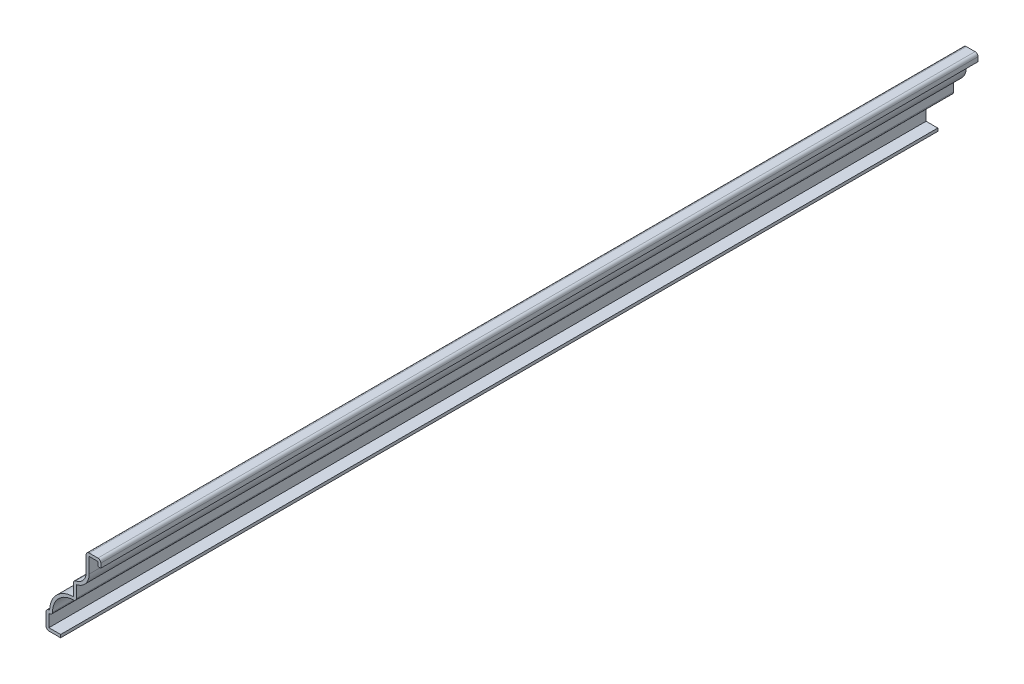
ISO-10303-21;
HEADER;
FILE_DESCRIPTION(('STEP AP214'),'2;1');
FILE_NAME('part.step','',(''),(''),'','','');
FILE_SCHEMA(('AUTOMOTIVE_DESIGN { 1 0 10303 214 1 1 1 1 }'));
ENDSEC;
DATA;
#1=APPLICATION_CONTEXT('core data for automotive mechanical design processes');
#2=APPLICATION_PROTOCOL_DEFINITION('international standard','automotive_design',2000,#1);
#3=PRODUCT_CONTEXT('',#1,'mechanical');
#4=PRODUCT('Part','Part','',(#3));
#5=PRODUCT_RELATED_PRODUCT_CATEGORY('part','',(#4));
#6=PRODUCT_DEFINITION_FORMATION('','',#4);
#7=PRODUCT_DEFINITION_CONTEXT('part definition',#1,'design');
#8=PRODUCT_DEFINITION('design','',#6,#7);
#9=PRODUCT_DEFINITION_SHAPE('','',#8);
#10=(LENGTH_UNIT() NAMED_UNIT(*) SI_UNIT(.MILLI.,.METRE.));
#11=(NAMED_UNIT(*) PLANE_ANGLE_UNIT() SI_UNIT($,.RADIAN.));
#12=(NAMED_UNIT(*) SI_UNIT($,.STERADIAN.) SOLID_ANGLE_UNIT());
#13=UNCERTAINTY_MEASURE_WITH_UNIT(LENGTH_MEASURE(1.E-05),#10,'distance_accuracy_value','');
#14=(GEOMETRIC_REPRESENTATION_CONTEXT(3) GLOBAL_UNCERTAINTY_ASSIGNED_CONTEXT((#13)) GLOBAL_UNIT_ASSIGNED_CONTEXT((#10,
#11,#12)) REPRESENTATION_CONTEXT('',''));
#15=CARTESIAN_POINT('',(0.,0.,0.));
#16=DIRECTION('',(0.,0.,1.));
#17=DIRECTION('',(1.,0.,0.));
#18=AXIS2_PLACEMENT_3D('',#15,#16,#17);
#19=CARTESIAN_POINT('',(-1.27,38.1,-381.));
#20=DIRECTION('',(-1.,0.,0.));
#21=DIRECTION('',(0.,-1.,0.));
#22=AXIS2_PLACEMENT_3D('',#19,#20,#21);
#23=PLANE('',#22);
#24=DIRECTION('',(0.,-1.,0.));
#25=VECTOR('',#24,1.);
#26=CARTESIAN_POINT('',(-1.27,38.1,0.));
#27=LINE('',#26,#25);
#28=CARTESIAN_POINT('',(-1.27,36.83,0.));
#29=VERTEX_POINT('',#28);
#30=CARTESIAN_POINT('',(-1.27,34.925,0.));
#31=VERTEX_POINT('',#30);
#32=EDGE_CURVE('E288',#29,#31,#27,.T.);
#33=ORIENTED_EDGE('',*,*,#32,.F.);
#34=DIRECTION('',(0.,0.,1.));
#35=VECTOR('',#34,1.);
#36=CARTESIAN_POINT('',(-1.27,36.83,-381.));
#37=LINE('',#36,#35);
#38=CARTESIAN_POINT('',(-1.27,36.83,-381.));
#39=VERTEX_POINT('',#38);
#40=EDGE_CURVE('E238',#39,#29,#37,.T.);
#41=ORIENTED_EDGE('',*,*,#40,.F.);
#42=DIRECTION('',(0.,-1.,0.));
#43=VECTOR('',#42,1.);
#44=CARTESIAN_POINT('',(-1.27,38.1,-381.));
#45=LINE('',#44,#43);
#46=CARTESIAN_POINT('',(-1.27,34.925,-381.));
#47=VERTEX_POINT('',#46);
#48=EDGE_CURVE('E220',#39,#47,#45,.T.);
#49=ORIENTED_EDGE('',*,*,#48,.T.);
#50=DIRECTION('',(0.,0.,1.));
#51=VECTOR('',#50,1.);
#52=CARTESIAN_POINT('',(-1.27,34.925,-381.));
#53=LINE('',#52,#51);
#54=EDGE_CURVE('E228',#47,#31,#53,.T.);
#55=ORIENTED_EDGE('',*,*,#54,.T.);
#56=EDGE_LOOP('',(#33,#41,#49,#55));
#57=FACE_BOUND('',#56,.T.);
#58=ADVANCED_FACE('F34',(#57),#23,.T.);
#59=CARTESIAN_POINT('',(-6.35,36.83,-381.));
#60=DIRECTION('',(0.,-1.,0.));
#61=DIRECTION('',(0.,0.,-1.));
#62=AXIS2_PLACEMENT_3D('',#59,#60,#61);
#63=PLANE('',#62);
#64=DIRECTION('',(1.,0.,0.));
#65=VECTOR('',#64,1.);
#66=CARTESIAN_POINT('',(-6.35,36.83,0.));
#67=LINE('',#66,#65);
#68=CARTESIAN_POINT('',(-5.08,36.83,0.));
#69=VERTEX_POINT('',#68);
#70=EDGE_CURVE('E239',#69,#29,#67,.T.);
#71=ORIENTED_EDGE('',*,*,#70,.F.);
#72=DIRECTION('',(0.,0.,1.));
#73=VECTOR('',#72,1.);
#74=CARTESIAN_POINT('',(-5.08,36.83,-381.));
#75=LINE('',#74,#73);
#76=CARTESIAN_POINT('',(-5.08,36.83,-381.));
#77=VERTEX_POINT('',#76);
#78=EDGE_CURVE('E336',#77,#69,#75,.T.);
#79=ORIENTED_EDGE('',*,*,#78,.F.);
#80=DIRECTION('',(1.,0.,0.));
#81=VECTOR('',#80,1.);
#82=CARTESIAN_POINT('',(-6.35,36.83,-381.));
#83=LINE('',#82,#81);
#84=EDGE_CURVE('E236',#77,#39,#83,.T.);
#85=ORIENTED_EDGE('',*,*,#84,.T.);
#86=ORIENTED_EDGE('',*,*,#40,.T.);
#87=EDGE_LOOP('',(#71,#79,#85,#86));
#88=FACE_BOUND('',#87,.T.);
#89=ADVANCED_FACE('F454',(#88),#63,.T.);
#90=CARTESIAN_POINT('',(-5.08,30.1625,-381.));
#91=DIRECTION('',(1.,0.,0.));
#92=DIRECTION('',(0.,1.,0.));
#93=AXIS2_PLACEMENT_3D('',#90,#91,#92);
#94=PLANE('',#93);
#95=DIRECTION('',(0.,1.,0.));
#96=VECTOR('',#95,1.);
#97=CARTESIAN_POINT('',(-5.08,30.1625,0.));
#98=LINE('',#97,#96);
#99=CARTESIAN_POINT('',(-5.08,30.1625,0.));
#100=VERTEX_POINT('',#99);
#101=EDGE_CURVE('E242',#100,#69,#98,.T.);
#102=ORIENTED_EDGE('',*,*,#101,.F.);
#103=DIRECTION('',(0.,0.,1.));
#104=VECTOR('',#103,1.);
#105=CARTESIAN_POINT('',(-5.08,30.1625,-381.));
#106=LINE('',#105,#104);
#107=CARTESIAN_POINT('',(-5.08,30.1625,-381.));
#108=VERTEX_POINT('',#107);
#109=EDGE_CURVE('E338',#108,#100,#106,.T.);
#110=ORIENTED_EDGE('',*,*,#109,.F.);
#111=DIRECTION('',(0.,1.,0.));
#112=VECTOR('',#111,1.);
#113=CARTESIAN_POINT('',(-5.08,30.1625,-381.));
#114=LINE('',#113,#112);
#115=EDGE_CURVE('E284',#108,#77,#114,.T.);
#116=ORIENTED_EDGE('',*,*,#115,.T.);
#117=ORIENTED_EDGE('',*,*,#78,.T.);
#118=EDGE_LOOP('',(#102,#110,#116,#117));
#119=FACE_BOUND('',#118,.T.);
#120=ADVANCED_FACE('F535',(#119),#94,.T.);
#121=CARTESIAN_POINT('',(-11.90625,30.1625,-381.));
#122=DIRECTION('',(0.,0.,1.));
#123=DIRECTION('',(1.,0.,0.));
#124=AXIS2_PLACEMENT_3D('',#121,#122,#123);
#125=CYLINDRICAL_SURFACE('',#124,6.82625);
#126=CARTESIAN_POINT('',(-11.90625,30.1625,0.));
#127=DIRECTION('',(0.,0.,1.));
#128=DIRECTION('',(1.,0.,0.));
#129=AXIS2_PLACEMENT_3D('',#126,#127,#128);
#130=CIRCLE('',#129,6.82625);
#131=CARTESIAN_POINT('',(-10.63625,23.4554299196669,0.));
#132=VERTEX_POINT('',#131);
#133=EDGE_CURVE('E329',#132,#100,#130,.T.);
#134=ORIENTED_EDGE('',*,*,#133,.F.);
#135=DIRECTION('',(0.,0.,1.));
#136=VECTOR('',#135,1.);
#137=CARTESIAN_POINT('',(-10.63625,23.4554299196669,-381.));
#138=LINE('',#137,#136);
#139=CARTESIAN_POINT('',(-10.63625,23.4554299196669,-381.));
#140=VERTEX_POINT('',#139);
#141=EDGE_CURVE('E340',#140,#132,#138,.T.);
#142=ORIENTED_EDGE('',*,*,#141,.F.);
#143=CARTESIAN_POINT('',(-11.90625,30.1625,-381.));
#144=DIRECTION('',(0.,0.,1.));
#145=DIRECTION('',(1.,0.,0.));
#146=AXIS2_PLACEMENT_3D('',#143,#144,#145);
#147=CIRCLE('',#146,6.82625);
#148=EDGE_CURVE('E281',#140,#108,#147,.T.);
#149=ORIENTED_EDGE('',*,*,#148,.T.);
#150=ORIENTED_EDGE('',*,*,#109,.T.);
#151=EDGE_LOOP('',(#134,#142,#149,#150));
#152=FACE_BOUND('',#151,.T.);
#153=ADVANCED_FACE('F462',(#152),#125,.T.);
#154=CARTESIAN_POINT('',(-10.63625,18.25625,-381.));
#155=DIRECTION('',(1.,0.,0.));
#156=DIRECTION('',(0.,1.,0.));
#157=AXIS2_PLACEMENT_3D('',#154,#155,#156);
#158=PLANE('',#157);
#159=DIRECTION('',(0.,1.,0.));
#160=VECTOR('',#159,1.);
#161=CARTESIAN_POINT('',(-10.63625,18.25625,0.));
#162=LINE('',#161,#160);
#163=CARTESIAN_POINT('',(-10.63625,18.25625,0.));
#164=VERTEX_POINT('',#163);
#165=EDGE_CURVE('E327',#164,#132,#162,.T.);
#166=ORIENTED_EDGE('',*,*,#165,.F.);
#167=DIRECTION('',(0.,0.,1.));
#168=VECTOR('',#167,1.);
#169=CARTESIAN_POINT('',(-10.63625,18.25625,-381.));
#170=LINE('',#169,#168);
#171=CARTESIAN_POINT('',(-10.63625,18.25625,-381.));
#172=VERTEX_POINT('',#171);
#173=EDGE_CURVE('E406',#164,#172,#170,.F.);
#174=ORIENTED_EDGE('',*,*,#173,.T.);
#175=DIRECTION('',(0.,1.,0.));
#176=VECTOR('',#175,1.);
#177=CARTESIAN_POINT('',(-10.63625,18.25625,-381.));
#178=LINE('',#177,#176);
#179=EDGE_CURVE('E279',#172,#140,#178,.T.);
#180=ORIENTED_EDGE('',*,*,#179,.T.);
#181=ORIENTED_EDGE('',*,*,#141,.T.);
#182=EDGE_LOOP('',(#166,#174,#180,#181));
#183=FACE_BOUND('',#182,.T.);
#184=ADVANCED_FACE('F465',(#183),#158,.T.);
#185=CARTESIAN_POINT('',(-11.90625,7.9375,-381.));
#186=DIRECTION('',(0.,0.,1.));
#187=DIRECTION('',(1.,0.,0.));
#188=AXIS2_PLACEMENT_3D('',#185,#186,#187);
#189=CYLINDRICAL_SURFACE('',#188,9.04875);
#190=CARTESIAN_POINT('',(-11.90625,7.9375,0.));
#191=DIRECTION('',(0.,0.,1.));
#192=DIRECTION('',(1.,0.,0.));
#193=AXIS2_PLACEMENT_3D('',#190,#191,#192);
#194=CIRCLE('',#193,9.04875);
#195=CARTESIAN_POINT('',(-20.955,7.9375,0.));
#196=VERTEX_POINT('',#195);
#197=CARTESIAN_POINT('',(-11.90625,16.98625,0.));
#198=VERTEX_POINT('',#197);
#199=EDGE_CURVE('E324',#196,#198,#194,.F.);
#200=ORIENTED_EDGE('',*,*,#199,.F.);
#201=DIRECTION('',(0.,0.,1.));
#202=VECTOR('',#201,1.);
#203=CARTESIAN_POINT('',(-20.955,7.9375,-381.));
#204=LINE('',#203,#202);
#205=CARTESIAN_POINT('',(-20.955,7.9375,-381.));
#206=VERTEX_POINT('',#205);
#207=EDGE_CURVE('E404',#196,#206,#204,.F.);
#208=ORIENTED_EDGE('',*,*,#207,.T.);
#209=CARTESIAN_POINT('',(-11.90625,7.9375,-381.));
#210=DIRECTION('',(0.,0.,1.));
#211=DIRECTION('',(1.,0.,0.));
#212=AXIS2_PLACEMENT_3D('',#209,#210,#211);
#213=CIRCLE('',#212,9.04875);
#214=CARTESIAN_POINT('',(-11.90625,16.98625,-381.));
#215=VERTEX_POINT('',#214);
#216=EDGE_CURVE('E276',#206,#215,#213,.F.);
#217=ORIENTED_EDGE('',*,*,#216,.T.);
#218=DIRECTION('',(0.,0.,1.));
#219=VECTOR('',#218,1.);
#220=CARTESIAN_POINT('',(-11.90625,16.98625,-381.));
#221=LINE('',#220,#219);
#222=EDGE_CURVE('E401',#215,#198,#221,.T.);
#223=ORIENTED_EDGE('',*,*,#222,.T.);
#224=EDGE_LOOP('',(#200,#208,#217,#223));
#225=FACE_BOUND('',#224,.T.);
#226=ADVANCED_FACE('F474',(#225),#189,.F.);
#227=CARTESIAN_POINT('',(-23.8125,6.6675,-381.));
#228=DIRECTION('',(0.,-1.,0.));
#229=DIRECTION('',(1.,0.,0.));
#230=AXIS2_PLACEMENT_3D('',#227,#228,#229);
#231=PLANE('',#230);
#232=DIRECTION('',(1.,0.,0.));
#233=VECTOR('',#232,1.);
#234=CARTESIAN_POINT('',(-23.8125,6.6675,-381.));
#235=LINE('',#234,#233);
#236=CARTESIAN_POINT('',(-22.5425,6.6675,-381.));
#237=VERTEX_POINT('',#236);
#238=CARTESIAN_POINT('',(-22.225,6.6675,-381.));
#239=VERTEX_POINT('',#238);
#240=EDGE_CURVE('E273',#237,#239,#235,.T.);
#241=ORIENTED_EDGE('',*,*,#240,.T.);
#242=DIRECTION('',(0.,0.,1.));
#243=VECTOR('',#242,1.);
#244=CARTESIAN_POINT('',(-22.225,6.6675,-381.));
#245=LINE('',#244,#243);
#246=CARTESIAN_POINT('',(-22.225,6.6675,0.));
#247=VERTEX_POINT('',#246);
#248=EDGE_CURVE('E398',#239,#247,#245,.T.);
#249=ORIENTED_EDGE('',*,*,#248,.T.);
#250=DIRECTION('',(1.,0.,0.));
#251=VECTOR('',#250,1.);
#252=CARTESIAN_POINT('',(-23.8125,6.6675,0.));
#253=LINE('',#252,#251);
#254=CARTESIAN_POINT('',(-22.5425,6.6675,0.));
#255=VERTEX_POINT('',#254);
#256=EDGE_CURVE('E321',#255,#247,#253,.T.);
#257=ORIENTED_EDGE('',*,*,#256,.F.);
#258=DIRECTION('',(0.,0.,1.));
#259=VECTOR('',#258,1.);
#260=CARTESIAN_POINT('',(-22.5425,6.6675,-381.));
#261=LINE('',#260,#259);
#262=EDGE_CURVE('E343',#237,#255,#261,.T.);
#263=ORIENTED_EDGE('',*,*,#262,.F.);
#264=EDGE_LOOP('',(#241,#249,#257,#263));
#265=FACE_BOUND('',#264,.T.);
#266=ADVANCED_FACE('F482',(#265),#231,.T.);
#267=CARTESIAN_POINT('',(-22.5425,0.,-381.));
#268=DIRECTION('',(1.,0.,0.));
#269=DIRECTION('',(0.,0.,-1.));
#270=AXIS2_PLACEMENT_3D('',#267,#268,#269);
#271=PLANE('',#270);
#272=DIRECTION('',(0.,1.,0.));
#273=VECTOR('',#272,1.);
#274=CARTESIAN_POINT('',(-22.5425,0.,0.));
#275=LINE('',#274,#273);
#276=CARTESIAN_POINT('',(-22.5425,1.27,0.));
#277=VERTEX_POINT('',#276);
#278=EDGE_CURVE('E318',#277,#255,#275,.T.);
#279=ORIENTED_EDGE('',*,*,#278,.F.);
#280=DIRECTION('',(0.,0.,1.));
#281=VECTOR('',#280,1.);
#282=CARTESIAN_POINT('',(-22.5425,1.27,-381.));
#283=LINE('',#282,#281);
#284=CARTESIAN_POINT('',(-22.5425,1.27,-381.));
#285=VERTEX_POINT('',#284);
#286=EDGE_CURVE('E345',#285,#277,#283,.T.);
#287=ORIENTED_EDGE('',*,*,#286,.F.);
#288=DIRECTION('',(0.,1.,0.));
#289=VECTOR('',#288,1.);
#290=CARTESIAN_POINT('',(-22.5425,0.,-381.));
#291=LINE('',#290,#289);
#292=EDGE_CURVE('E270',#285,#237,#291,.T.);
#293=ORIENTED_EDGE('',*,*,#292,.T.);
#294=ORIENTED_EDGE('',*,*,#262,.T.);
#295=EDGE_LOOP('',(#279,#287,#293,#294));
#296=FACE_BOUND('',#295,.T.);
#297=ADVANCED_FACE('F488',(#296),#271,.T.);
#298=CARTESIAN_POINT('',(-17.4625,1.27,-381.));
#299=DIRECTION('',(0.,1.,0.));
#300=DIRECTION('',(-1.,0.,0.));
#301=AXIS2_PLACEMENT_3D('',#298,#299,#300);
#302=PLANE('',#301);
#303=DIRECTION('',(-1.,0.,0.));
#304=VECTOR('',#303,1.);
#305=CARTESIAN_POINT('',(-17.4625,1.27,0.));
#306=LINE('',#305,#304);
#307=CARTESIAN_POINT('',(-17.4625,1.27,0.));
#308=VERTEX_POINT('',#307);
#309=EDGE_CURVE('E315',#308,#277,#306,.T.);
#310=ORIENTED_EDGE('',*,*,#309,.F.);
#311=DIRECTION('',(0.,0.,1.));
#312=VECTOR('',#311,1.);
#313=CARTESIAN_POINT('',(-17.4625,1.27,-381.));
#314=LINE('',#313,#312);
#315=CARTESIAN_POINT('',(-17.4625,1.27,-381.));
#316=VERTEX_POINT('',#315);
#317=EDGE_CURVE('E347',#316,#308,#314,.T.);
#318=ORIENTED_EDGE('',*,*,#317,.F.);
#319=DIRECTION('',(-1.,0.,0.));
#320=VECTOR('',#319,1.);
#321=CARTESIAN_POINT('',(-17.4625,1.27,-381.));
#322=LINE('',#321,#320);
#323=EDGE_CURVE('E267',#316,#285,#322,.T.);
#324=ORIENTED_EDGE('',*,*,#323,.T.);
#325=ORIENTED_EDGE('',*,*,#286,.T.);
#326=EDGE_LOOP('',(#310,#318,#324,#325));
#327=FACE_BOUND('',#326,.T.);
#328=ADVANCED_FACE('F491',(#327),#302,.T.);
#329=CARTESIAN_POINT('',(-17.4625,1.27,-381.));
#330=DIRECTION('',(-1.,0.,0.));
#331=DIRECTION('',(0.,0.,1.));
#332=AXIS2_PLACEMENT_3D('',#329,#330,#331);
#333=PLANE('',#332);
#334=DIRECTION('',(0.,-1.,0.));
#335=VECTOR('',#334,1.);
#336=CARTESIAN_POINT('',(-17.4625,1.27,0.));
#337=LINE('',#336,#335);
#338=CARTESIAN_POINT('',(-17.4625,0.,0.));
#339=VERTEX_POINT('',#338);
#340=EDGE_CURVE('E313',#308,#339,#337,.T.);
#341=ORIENTED_EDGE('',*,*,#340,.T.);
#342=DIRECTION('',(0.,0.,1.));
#343=VECTOR('',#342,1.);
#344=CARTESIAN_POINT('',(-17.4625,0.,-381.));
#345=LINE('',#344,#343);
#346=CARTESIAN_POINT('',(-17.4625,0.,-381.));
#347=VERTEX_POINT('',#346);
#348=EDGE_CURVE('E349',#347,#339,#345,.T.);
#349=ORIENTED_EDGE('',*,*,#348,.F.);
#350=DIRECTION('',(0.,-1.,0.));
#351=VECTOR('',#350,1.);
#352=CARTESIAN_POINT('',(-17.4625,1.27,-381.));
#353=LINE('',#352,#351);
#354=EDGE_CURVE('E265',#316,#347,#353,.T.);
#355=ORIENTED_EDGE('',*,*,#354,.F.);
#356=ORIENTED_EDGE('',*,*,#317,.T.);
#357=EDGE_LOOP('',(#341,#349,#355,#356));
#358=FACE_BOUND('',#357,.T.);
#359=ADVANCED_FACE('F497',(#358),#333,.F.);
#360=CARTESIAN_POINT('',(-17.4625,0.,-381.));
#361=DIRECTION('',(0.,1.,0.));
#362=DIRECTION('',(-1.,0.,0.));
#363=AXIS2_PLACEMENT_3D('',#360,#361,#362);
#364=PLANE('',#363);
#365=DIRECTION('',(-1.,0.,0.));
#366=VECTOR('',#365,1.);
#367=CARTESIAN_POINT('',(-17.4625,0.,0.));
#368=LINE('',#367,#366);
#369=CARTESIAN_POINT('',(-22.5425,0.,0.));
#370=VERTEX_POINT('',#369);
#371=EDGE_CURVE('E310',#339,#370,#368,.T.);
#372=ORIENTED_EDGE('',*,*,#371,.T.);
#373=DIRECTION('',(0.,0.,1.));
#374=VECTOR('',#373,1.);
#375=CARTESIAN_POINT('',(-22.5425,0.,-381.));
#376=LINE('',#375,#374);
#377=CARTESIAN_POINT('',(-22.5425,0.,-381.));
#378=VERTEX_POINT('',#377);
#379=EDGE_CURVE('E380',#370,#378,#376,.F.);
#380=ORIENTED_EDGE('',*,*,#379,.T.);
#381=DIRECTION('',(-1.,0.,0.));
#382=VECTOR('',#381,1.);
#383=CARTESIAN_POINT('',(-17.4625,0.,-381.));
#384=LINE('',#383,#382);
#385=EDGE_CURVE('E263',#347,#378,#384,.T.);
#386=ORIENTED_EDGE('',*,*,#385,.F.);
#387=ORIENTED_EDGE('',*,*,#348,.T.);
#388=EDGE_LOOP('',(#372,#380,#386,#387));
#389=FACE_BOUND('',#388,.T.);
#390=ADVANCED_FACE('F501',(#389),#364,.F.);
#391=CARTESIAN_POINT('',(-23.8125,0.,-381.));
#392=DIRECTION('',(1.,0.,0.));
#393=DIRECTION('',(0.,0.,-1.));
#394=AXIS2_PLACEMENT_3D('',#391,#392,#393);
#395=PLANE('',#394);
#396=DIRECTION('',(0.,1.,0.));
#397=VECTOR('',#396,1.);
#398=CARTESIAN_POINT('',(-23.8125,0.,-381.));
#399=LINE('',#398,#397);
#400=CARTESIAN_POINT('',(-23.8125,1.27,-381.));
#401=VERTEX_POINT('',#400);
#402=CARTESIAN_POINT('',(-23.8125,6.6675,-381.));
#403=VERTEX_POINT('',#402);
#404=EDGE_CURVE('E260',#401,#403,#399,.T.);
#405=ORIENTED_EDGE('',*,*,#404,.F.);
#406=DIRECTION('',(0.,0.,1.));
#407=VECTOR('',#406,1.);
#408=CARTESIAN_POINT('',(-23.8125,1.27,-381.));
#409=LINE('',#408,#407);
#410=CARTESIAN_POINT('',(-23.8125,1.27,0.));
#411=VERTEX_POINT('',#410);
#412=EDGE_CURVE('E363',#401,#411,#409,.T.);
#413=ORIENTED_EDGE('',*,*,#412,.T.);
#414=DIRECTION('',(0.,1.,0.));
#415=VECTOR('',#414,1.);
#416=CARTESIAN_POINT('',(-23.8125,0.,0.));
#417=LINE('',#416,#415);
#418=CARTESIAN_POINT('',(-23.8125,6.6675,0.));
#419=VERTEX_POINT('',#418);
#420=EDGE_CURVE('E307',#411,#419,#417,.T.);
#421=ORIENTED_EDGE('',*,*,#420,.T.);
#422=DIRECTION('',(0.,0.,1.));
#423=VECTOR('',#422,1.);
#424=CARTESIAN_POINT('',(-23.8125,6.6675,-381.));
#425=LINE('',#424,#423);
#426=EDGE_CURVE('E335',#419,#403,#425,.F.);
#427=ORIENTED_EDGE('',*,*,#426,.T.);
#428=EDGE_LOOP('',(#405,#413,#421,#427));
#429=FACE_BOUND('',#428,.T.);
#430=ADVANCED_FACE('F509',(#429),#395,.F.);
#431=CARTESIAN_POINT('',(-23.8125,7.9375,-381.));
#432=DIRECTION('',(0.,-1.,0.));
#433=DIRECTION('',(1.,0.,0.));
#434=AXIS2_PLACEMENT_3D('',#431,#432,#433);
#435=PLANE('',#434);
#436=DIRECTION('',(1.,0.,0.));
#437=VECTOR('',#436,1.);
#438=CARTESIAN_POINT('',(-23.8125,7.9375,-381.));
#439=LINE('',#438,#437);
#440=CARTESIAN_POINT('',(-22.5425,7.9375,-381.));
#441=VERTEX_POINT('',#440);
#442=CARTESIAN_POINT('',(-22.225,7.9375,-381.));
#443=VERTEX_POINT('',#442);
#444=EDGE_CURVE('E258',#441,#443,#439,.T.);
#445=ORIENTED_EDGE('',*,*,#444,.F.);
#446=DIRECTION('',(0.,0.,1.));
#447=VECTOR('',#446,1.);
#448=CARTESIAN_POINT('',(-22.5425,7.9375,-381.));
#449=LINE('',#448,#447);
#450=CARTESIAN_POINT('',(-22.5425,7.9375,0.));
#451=VERTEX_POINT('',#450);
#452=EDGE_CURVE('E395',#441,#451,#449,.T.);
#453=ORIENTED_EDGE('',*,*,#452,.T.);
#454=DIRECTION('',(1.,0.,0.));
#455=VECTOR('',#454,1.);
#456=CARTESIAN_POINT('',(-23.8125,7.9375,0.));
#457=LINE('',#456,#455);
#458=CARTESIAN_POINT('',(-22.225,7.9375,0.));
#459=VERTEX_POINT('',#458);
#460=EDGE_CURVE('E305',#451,#459,#457,.T.);
#461=ORIENTED_EDGE('',*,*,#460,.T.);
#462=DIRECTION('',(0.,0.,1.));
#463=VECTOR('',#462,1.);
#464=CARTESIAN_POINT('',(-22.225,7.9375,-381.));
#465=LINE('',#464,#463);
#466=EDGE_CURVE('E352',#443,#459,#465,.T.);
#467=ORIENTED_EDGE('',*,*,#466,.F.);
#468=EDGE_LOOP('',(#445,#453,#461,#467));
#469=FACE_BOUND('',#468,.T.);
#470=ADVANCED_FACE('F517',(#469),#435,.F.);
#471=CARTESIAN_POINT('',(-11.90625,7.9375,-381.));
#472=DIRECTION('',(0.,0.,1.));
#473=DIRECTION('',(1.,0.,0.));
#474=AXIS2_PLACEMENT_3D('',#471,#472,#473);
#475=CYLINDRICAL_SURFACE('',#474,10.31875);
#476=CARTESIAN_POINT('',(-11.90625,7.9375,0.));
#477=DIRECTION('',(0.,0.,-1.));
#478=DIRECTION('',(-1.,0.,0.));
#479=AXIS2_PLACEMENT_3D('',#476,#477,#478);
#480=CIRCLE('',#479,10.31875);
#481=CARTESIAN_POINT('',(-11.90625,18.25625,0.));
#482=VERTEX_POINT('',#481);
#483=EDGE_CURVE('E303',#459,#482,#480,.T.);
#484=ORIENTED_EDGE('',*,*,#483,.T.);
#485=DIRECTION('',(0.,0.,1.));
#486=VECTOR('',#485,1.);
#487=CARTESIAN_POINT('',(-11.90625,18.25625,-381.));
#488=LINE('',#487,#486);
#489=CARTESIAN_POINT('',(-11.90625,18.25625,-381.));
#490=VERTEX_POINT('',#489);
#491=EDGE_CURVE('E355',#490,#482,#488,.T.);
#492=ORIENTED_EDGE('',*,*,#491,.F.);
#493=CARTESIAN_POINT('',(-11.90625,7.9375,-381.));
#494=DIRECTION('',(0.,0.,-1.));
#495=DIRECTION('',(-1.,0.,0.));
#496=AXIS2_PLACEMENT_3D('',#493,#494,#495);
#497=CIRCLE('',#496,10.31875);
#498=EDGE_CURVE('E256',#443,#490,#497,.T.);
#499=ORIENTED_EDGE('',*,*,#498,.F.);
#500=ORIENTED_EDGE('',*,*,#466,.T.);
#501=EDGE_LOOP('',(#484,#492,#499,#500));
#502=FACE_BOUND('',#501,.T.);
#503=ADVANCED_FACE('F521',(#502),#475,.T.);
#504=CARTESIAN_POINT('',(-11.90625,18.25625,-381.));
#505=DIRECTION('',(1.,0.,0.));
#506=DIRECTION('',(0.,1.,0.));
#507=AXIS2_PLACEMENT_3D('',#504,#505,#506);
#508=PLANE('',#507);
#509=DIRECTION('',(0.,1.,0.));
#510=VECTOR('',#509,1.);
#511=CARTESIAN_POINT('',(-11.90625,18.25625,0.));
#512=LINE('',#511,#510);
#513=CARTESIAN_POINT('',(-11.90625,23.4554299196669,0.));
#514=VERTEX_POINT('',#513);
#515=EDGE_CURVE('E300',#482,#514,#512,.T.);
#516=ORIENTED_EDGE('',*,*,#515,.T.);
#517=DIRECTION('',(0.,0.,1.));
#518=VECTOR('',#517,1.);
#519=CARTESIAN_POINT('',(-11.90625,23.4554299196669,-381.));
#520=LINE('',#519,#518);
#521=CARTESIAN_POINT('',(-11.90625,23.4554299196669,-381.));
#522=VERTEX_POINT('',#521);
#523=EDGE_CURVE('E42',#514,#522,#520,.F.);
#524=ORIENTED_EDGE('',*,*,#523,.T.);
#525=DIRECTION('',(0.,1.,0.));
#526=VECTOR('',#525,1.);
#527=CARTESIAN_POINT('',(-11.90625,18.25625,-381.));
#528=LINE('',#527,#526);
#529=EDGE_CURVE('E253',#490,#522,#528,.T.);
#530=ORIENTED_EDGE('',*,*,#529,.F.);
#531=ORIENTED_EDGE('',*,*,#491,.T.);
#532=EDGE_LOOP('',(#516,#524,#530,#531));
#533=FACE_BOUND('',#532,.T.);
#534=ADVANCED_FACE('F419',(#533),#508,.F.);
#535=CARTESIAN_POINT('',(-11.90625,30.1625,-381.));
#536=DIRECTION('',(0.,0.,1.));
#537=DIRECTION('',(1.,0.,0.));
#538=AXIS2_PLACEMENT_3D('',#535,#536,#537);
#539=CYLINDRICAL_SURFACE('',#538,5.55625);
#540=CARTESIAN_POINT('',(-11.90625,30.1625,-381.));
#541=DIRECTION('',(0.,0.,1.));
#542=DIRECTION('',(1.,0.,0.));
#543=AXIS2_PLACEMENT_3D('',#540,#541,#542);
#544=CIRCLE('',#543,5.55625);
#545=CARTESIAN_POINT('',(-10.8725290697674,24.7032569113567,-381.));
#546=VERTEX_POINT('',#545);
#547=CARTESIAN_POINT('',(-6.35,30.1625,-381.));
#548=VERTEX_POINT('',#547);
#549=EDGE_CURVE('E251',#546,#548,#544,.T.);
#550=ORIENTED_EDGE('',*,*,#549,.F.);
#551=DIRECTION('',(0.,0.,1.));
#552=VECTOR('',#551,1.);
#553=CARTESIAN_POINT('',(-10.8725290697674,24.7032569113567,-381.));
#554=LINE('',#553,#552);
#555=CARTESIAN_POINT('',(-10.8725290697674,24.7032569113567,0.));
#556=VERTEX_POINT('',#555);
#557=EDGE_CURVE('E414',#546,#556,#554,.T.);
#558=ORIENTED_EDGE('',*,*,#557,.T.);
#559=CARTESIAN_POINT('',(-11.90625,30.1625,0.));
#560=DIRECTION('',(0.,0.,1.));
#561=DIRECTION('',(1.,0.,0.));
#562=AXIS2_PLACEMENT_3D('',#559,#560,#561);
#563=CIRCLE('',#562,5.55625);
#564=CARTESIAN_POINT('',(-6.35,30.1625,0.));
#565=VERTEX_POINT('',#564);
#566=EDGE_CURVE('E298',#556,#565,#563,.T.);
#567=ORIENTED_EDGE('',*,*,#566,.T.);
#568=DIRECTION('',(0.,0.,1.));
#569=VECTOR('',#568,1.);
#570=CARTESIAN_POINT('',(-6.35,30.1625,-381.));
#571=LINE('',#570,#569);
#572=EDGE_CURVE('E358',#548,#565,#571,.T.);
#573=ORIENTED_EDGE('',*,*,#572,.F.);
#574=EDGE_LOOP('',(#550,#558,#567,#573));
#575=FACE_BOUND('',#574,.T.);
#576=ADVANCED_FACE('F430',(#575),#539,.F.);
#577=CARTESIAN_POINT('',(-6.35,30.1625,-381.));
#578=DIRECTION('',(1.,0.,0.));
#579=DIRECTION('',(0.,1.,0.));
#580=AXIS2_PLACEMENT_3D('',#577,#578,#579);
#581=PLANE('',#580);
#582=DIRECTION('',(0.,1.,0.));
#583=VECTOR('',#582,1.);
#584=CARTESIAN_POINT('',(-6.35,30.1625,0.));
#585=LINE('',#584,#583);
#586=CARTESIAN_POINT('',(-6.35,36.83,0.));
#587=VERTEX_POINT('',#586);
#588=EDGE_CURVE('E295',#565,#587,#585,.T.);
#589=ORIENTED_EDGE('',*,*,#588,.T.);
#590=DIRECTION('',(0.,0.,1.));
#591=VECTOR('',#590,1.);
#592=CARTESIAN_POINT('',(-6.35,36.83,-381.));
#593=LINE('',#592,#591);
#594=CARTESIAN_POINT('',(-6.35,36.83,-381.));
#595=VERTEX_POINT('',#594);
#596=EDGE_CURVE('E412',#587,#595,#593,.F.);
#597=ORIENTED_EDGE('',*,*,#596,.T.);
#598=DIRECTION('',(0.,1.,0.));
#599=VECTOR('',#598,1.);
#600=CARTESIAN_POINT('',(-6.35,30.1625,-381.));
#601=LINE('',#600,#599);
#602=EDGE_CURVE('E248',#548,#595,#601,.T.);
#603=ORIENTED_EDGE('',*,*,#602,.F.);
#604=ORIENTED_EDGE('',*,*,#572,.T.);
#605=EDGE_LOOP('',(#589,#597,#603,#604));
#606=FACE_BOUND('',#605,.T.);
#607=ADVANCED_FACE('F439',(#606),#581,.F.);
#608=CARTESIAN_POINT('',(-6.35,38.1,-381.));
#609=DIRECTION('',(0.,-1.,0.));
#610=DIRECTION('',(0.,0.,-1.));
#611=AXIS2_PLACEMENT_3D('',#608,#609,#610);
#612=PLANE('',#611);
#613=DIRECTION('',(1.,0.,0.));
#614=VECTOR('',#613,1.);
#615=CARTESIAN_POINT('',(-6.35,38.1,-381.));
#616=LINE('',#615,#614);
#617=CARTESIAN_POINT('',(-5.08,38.1,-381.));
#618=VERTEX_POINT('',#617);
#619=CARTESIAN_POINT('',(-1.27,38.1,-381.));
#620=VERTEX_POINT('',#619);
#621=EDGE_CURVE('E246',#618,#620,#616,.T.);
#622=ORIENTED_EDGE('',*,*,#621,.F.);
#623=DIRECTION('',(0.,0.,1.));
#624=VECTOR('',#623,1.);
#625=CARTESIAN_POINT('',(-5.08,38.1,-381.));
#626=LINE('',#625,#624);
#627=CARTESIAN_POINT('',(-5.08,38.1,0.));
#628=VERTEX_POINT('',#627);
#629=EDGE_CURVE('E409',#618,#628,#626,.T.);
#630=ORIENTED_EDGE('',*,*,#629,.T.);
#631=DIRECTION('',(1.,0.,0.));
#632=VECTOR('',#631,1.);
#633=CARTESIAN_POINT('',(-6.35,38.1,0.));
#634=LINE('',#633,#632);
#635=CARTESIAN_POINT('',(-1.27,38.1,0.));
#636=VERTEX_POINT('',#635);
#637=EDGE_CURVE('E293',#628,#636,#634,.T.);
#638=ORIENTED_EDGE('',*,*,#637,.T.);
#639=DIRECTION('',(0.,0.,1.));
#640=VECTOR('',#639,1.);
#641=CARTESIAN_POINT('',(-1.27,38.1,-381.));
#642=LINE('',#641,#640);
#643=EDGE_CURVE('E57',#636,#620,#642,.F.);
#644=ORIENTED_EDGE('',*,*,#643,.T.);
#645=EDGE_LOOP('',(#622,#630,#638,#644));
#646=FACE_BOUND('',#645,.T.);
#647=ADVANCED_FACE('F445',(#646),#612,.F.);
#648=CARTESIAN_POINT('',(0.,38.1,-381.));
#649=DIRECTION('',(-1.,0.,0.));
#650=DIRECTION('',(0.,-1.,0.));
#651=AXIS2_PLACEMENT_3D('',#648,#649,#650);
#652=PLANE('',#651);
#653=DIRECTION('',(0.,-1.,0.));
#654=VECTOR('',#653,1.);
#655=CARTESIAN_POINT('',(0.,38.1,-381.));
#656=LINE('',#655,#654);
#657=CARTESIAN_POINT('',(0.,36.83,-381.));
#658=VERTEX_POINT('',#657);
#659=CARTESIAN_POINT('',(0.,34.925,-381.));
#660=VERTEX_POINT('',#659);
#661=EDGE_CURVE('E222',#658,#660,#656,.T.);
#662=ORIENTED_EDGE('',*,*,#661,.F.);
#663=DIRECTION('',(0.,0.,1.));
#664=VECTOR('',#663,1.);
#665=CARTESIAN_POINT('',(0.,36.83,-381.));
#666=LINE('',#665,#664);
#667=CARTESIAN_POINT('',(0.,36.83,0.));
#668=VERTEX_POINT('',#667);
#669=EDGE_CURVE('E11',#658,#668,#666,.T.);
#670=ORIENTED_EDGE('',*,*,#669,.T.);
#671=DIRECTION('',(0.,-1.,0.));
#672=VECTOR('',#671,1.);
#673=CARTESIAN_POINT('',(0.,38.1,0.));
#674=LINE('',#673,#672);
#675=CARTESIAN_POINT('',(0.,34.925,0.));
#676=VERTEX_POINT('',#675);
#677=EDGE_CURVE('E291',#668,#676,#674,.T.);
#678=ORIENTED_EDGE('',*,*,#677,.T.);
#679=DIRECTION('',(0.,0.,1.));
#680=VECTOR('',#679,1.);
#681=CARTESIAN_POINT('',(0.,34.925,-381.));
#682=LINE('',#681,#680);
#683=EDGE_CURVE('E235',#660,#676,#682,.T.);
#684=ORIENTED_EDGE('',*,*,#683,.F.);
#685=EDGE_LOOP('',(#662,#670,#678,#684));
#686=FACE_BOUND('',#685,.T.);
#687=ADVANCED_FACE('F450',(#686),#652,.F.);
#688=CARTESIAN_POINT('',(0.,34.925,-381.));
#689=DIRECTION('',(0.,1.,0.));
#690=DIRECTION('',(0.,0.,1.));
#691=AXIS2_PLACEMENT_3D('',#688,#689,#690);
#692=PLANE('',#691);
#693=DIRECTION('',(-1.,0.,0.));
#694=VECTOR('',#693,1.);
#695=CARTESIAN_POINT('',(0.,34.925,0.));
#696=LINE('',#695,#694);
#697=EDGE_CURVE('E231',#676,#31,#696,.T.);
#698=ORIENTED_EDGE('',*,*,#697,.T.);
#699=ORIENTED_EDGE('',*,*,#54,.F.);
#700=DIRECTION('',(-1.,0.,0.));
#701=VECTOR('',#700,1.);
#702=CARTESIAN_POINT('',(0.,34.925,-381.));
#703=LINE('',#702,#701);
#704=EDGE_CURVE('E214',#660,#47,#703,.T.);
#705=ORIENTED_EDGE('',*,*,#704,.F.);
#706=ORIENTED_EDGE('',*,*,#683,.T.);
#707=EDGE_LOOP('',(#698,#699,#705,#706));
#708=FACE_BOUND('',#707,.T.);
#709=ADVANCED_FACE('F229',(#708),#692,.F.);
#710=CARTESIAN_POINT('',(-11.90625,30.1625,-381.));
#711=DIRECTION('',(0.,0.,1.));
#712=DIRECTION('',(1.,0.,0.));
#713=AXIS2_PLACEMENT_3D('',#710,#711,#712);
#714=PLANE('',#713);
#715=ORIENTED_EDGE('',*,*,#385,.T.);
#716=CARTESIAN_POINT('',(-22.5425,1.27,-381.));
#717=DIRECTION('',(0.,0.,1.));
#718=DIRECTION('',(1.,0.,0.));
#719=AXIS2_PLACEMENT_3D('',#716,#717,#718);
#720=CIRCLE('',#719,1.27);
#721=EDGE_CURVE('E393',#378,#401,#720,.F.);
#722=ORIENTED_EDGE('',*,*,#721,.T.);
#723=ORIENTED_EDGE('',*,*,#404,.T.);
#724=CARTESIAN_POINT('',(-22.5425,6.6675,-381.));
#725=DIRECTION('',(0.,0.,1.));
#726=DIRECTION('',(1.,0.,0.));
#727=AXIS2_PLACEMENT_3D('',#724,#725,#726);
#728=CIRCLE('',#727,1.27);
#729=EDGE_CURVE('E391',#403,#441,#728,.F.);
#730=ORIENTED_EDGE('',*,*,#729,.T.);
#731=ORIENTED_EDGE('',*,*,#444,.T.);
#732=ORIENTED_EDGE('',*,*,#498,.T.);
#733=ORIENTED_EDGE('',*,*,#529,.T.);
#734=CARTESIAN_POINT('',(-10.63625,23.4554299196669,-381.));
#735=DIRECTION('',(0.,0.,1.));
#736=DIRECTION('',(1.,0.,0.));
#737=AXIS2_PLACEMENT_3D('',#734,#735,#736);
#738=CIRCLE('',#737,1.27);
#739=EDGE_CURVE('E383',#522,#546,#738,.F.);
#740=ORIENTED_EDGE('',*,*,#739,.T.);
#741=ORIENTED_EDGE('',*,*,#549,.T.);
#742=ORIENTED_EDGE('',*,*,#602,.T.);
#743=CARTESIAN_POINT('',(-5.08,36.83,-381.));
#744=DIRECTION('',(0.,0.,1.));
#745=DIRECTION('',(1.,0.,0.));
#746=AXIS2_PLACEMENT_3D('',#743,#744,#745);
#747=CIRCLE('',#746,1.27);
#748=EDGE_CURVE('E385',#595,#618,#747,.F.);
#749=ORIENTED_EDGE('',*,*,#748,.T.);
#750=ORIENTED_EDGE('',*,*,#621,.T.);
#751=CARTESIAN_POINT('',(-1.27,36.83,-381.));
#752=DIRECTION('',(0.,0.,1.));
#753=DIRECTION('',(1.,0.,0.));
#754=AXIS2_PLACEMENT_3D('',#751,#752,#753);
#755=CIRCLE('',#754,1.27);
#756=EDGE_CURVE('E49',#620,#658,#755,.F.);
#757=ORIENTED_EDGE('',*,*,#756,.T.);
#758=ORIENTED_EDGE('',*,*,#661,.T.);
#759=ORIENTED_EDGE('',*,*,#704,.T.);
#760=ORIENTED_EDGE('',*,*,#48,.F.);
#761=ORIENTED_EDGE('',*,*,#84,.F.);
#762=ORIENTED_EDGE('',*,*,#115,.F.);
#763=ORIENTED_EDGE('',*,*,#148,.F.);
#764=ORIENTED_EDGE('',*,*,#179,.F.);
#765=CARTESIAN_POINT('',(-11.90625,18.25625,-381.));
#766=DIRECTION('',(0.,0.,1.));
#767=DIRECTION('',(1.,0.,0.));
#768=AXIS2_PLACEMENT_3D('',#765,#766,#767);
#769=CIRCLE('',#768,1.27);
#770=EDGE_CURVE('E387',#172,#215,#769,.F.);
#771=ORIENTED_EDGE('',*,*,#770,.T.);
#772=ORIENTED_EDGE('',*,*,#216,.F.);
#773=CARTESIAN_POINT('',(-22.225,7.9375,-381.));
#774=DIRECTION('',(0.,0.,1.));
#775=DIRECTION('',(1.,0.,0.));
#776=AXIS2_PLACEMENT_3D('',#773,#774,#775);
#777=CIRCLE('',#776,1.27);
#778=EDGE_CURVE('E389',#206,#239,#777,.F.);
#779=ORIENTED_EDGE('',*,*,#778,.T.);
#780=ORIENTED_EDGE('',*,*,#240,.F.);
#781=ORIENTED_EDGE('',*,*,#292,.F.);
#782=ORIENTED_EDGE('',*,*,#323,.F.);
#783=ORIENTED_EDGE('',*,*,#354,.T.);
#784=EDGE_LOOP('',(#715,#722,#723,#730,#731,#732,#733,#740,#741,#742,#749,#750,#757,#758,#759,
#760,#761,#762,#763,#764,#771,#772,#779,#780,#781,#782,#783));
#785=FACE_BOUND('',#784,.T.);
#786=ADVANCED_FACE('F217',(#785),#714,.F.);
#787=CARTESIAN_POINT('',(-11.90625,30.1625,0.));
#788=DIRECTION('',(0.,0.,1.));
#789=DIRECTION('',(1.,0.,0.));
#790=AXIS2_PLACEMENT_3D('',#787,#788,#789);
#791=PLANE('',#790);
#792=ORIENTED_EDGE('',*,*,#420,.F.);
#793=CARTESIAN_POINT('',(-22.5425,1.27,0.));
#794=DIRECTION('',(0.,0.,1.));
#795=DIRECTION('',(1.,0.,0.));
#796=AXIS2_PLACEMENT_3D('',#793,#794,#795);
#797=CIRCLE('',#796,1.27);
#798=EDGE_CURVE('E378',#411,#370,#797,.T.);
#799=ORIENTED_EDGE('',*,*,#798,.T.);
#800=ORIENTED_EDGE('',*,*,#371,.F.);
#801=ORIENTED_EDGE('',*,*,#340,.F.);
#802=ORIENTED_EDGE('',*,*,#309,.T.);
#803=ORIENTED_EDGE('',*,*,#278,.T.);
#804=ORIENTED_EDGE('',*,*,#256,.T.);
#805=CARTESIAN_POINT('',(-22.225,7.9375,0.));
#806=DIRECTION('',(0.,0.,1.));
#807=DIRECTION('',(1.,0.,0.));
#808=AXIS2_PLACEMENT_3D('',#805,#806,#807);
#809=CIRCLE('',#808,1.27);
#810=EDGE_CURVE('E374',#247,#196,#809,.T.);
#811=ORIENTED_EDGE('',*,*,#810,.T.);
#812=ORIENTED_EDGE('',*,*,#199,.T.);
#813=CARTESIAN_POINT('',(-11.90625,18.25625,0.));
#814=DIRECTION('',(0.,0.,1.));
#815=DIRECTION('',(1.,0.,0.));
#816=AXIS2_PLACEMENT_3D('',#813,#814,#815);
#817=CIRCLE('',#816,1.27);
#818=EDGE_CURVE('E372',#198,#164,#817,.T.);
#819=ORIENTED_EDGE('',*,*,#818,.T.);
#820=ORIENTED_EDGE('',*,*,#165,.T.);
#821=ORIENTED_EDGE('',*,*,#133,.T.);
#822=ORIENTED_EDGE('',*,*,#101,.T.);
#823=ORIENTED_EDGE('',*,*,#70,.T.);
#824=ORIENTED_EDGE('',*,*,#32,.T.);
#825=ORIENTED_EDGE('',*,*,#697,.F.);
#826=ORIENTED_EDGE('',*,*,#677,.F.);
#827=CARTESIAN_POINT('',(-1.27,36.83,0.));
#828=DIRECTION('',(0.,0.,1.));
#829=DIRECTION('',(1.,0.,0.));
#830=AXIS2_PLACEMENT_3D('',#827,#828,#829);
#831=CIRCLE('',#830,1.27);
#832=EDGE_CURVE('E366',#668,#636,#831,.T.);
#833=ORIENTED_EDGE('',*,*,#832,.T.);
#834=ORIENTED_EDGE('',*,*,#637,.F.);
#835=CARTESIAN_POINT('',(-5.08,36.83,0.));
#836=DIRECTION('',(0.,0.,1.));
#837=DIRECTION('',(1.,0.,0.));
#838=AXIS2_PLACEMENT_3D('',#835,#836,#837);
#839=CIRCLE('',#838,1.27);
#840=EDGE_CURVE('E370',#628,#587,#839,.T.);
#841=ORIENTED_EDGE('',*,*,#840,.T.);
#842=ORIENTED_EDGE('',*,*,#588,.F.);
#843=ORIENTED_EDGE('',*,*,#566,.F.);
#844=CARTESIAN_POINT('',(-10.63625,23.4554299196669,0.));
#845=DIRECTION('',(0.,0.,1.));
#846=DIRECTION('',(1.,0.,0.));
#847=AXIS2_PLACEMENT_3D('',#844,#845,#846);
#848=CIRCLE('',#847,1.27);
#849=EDGE_CURVE('E368',#556,#514,#848,.T.);
#850=ORIENTED_EDGE('',*,*,#849,.T.);
#851=ORIENTED_EDGE('',*,*,#515,.F.);
#852=ORIENTED_EDGE('',*,*,#483,.F.);
#853=ORIENTED_EDGE('',*,*,#460,.F.);
#854=CARTESIAN_POINT('',(-22.5425,6.6675,0.));
#855=DIRECTION('',(0.,0.,1.));
#856=DIRECTION('',(1.,0.,0.));
#857=AXIS2_PLACEMENT_3D('',#854,#855,#856);
#858=CIRCLE('',#857,1.27);
#859=EDGE_CURVE('E376',#451,#419,#858,.T.);
#860=ORIENTED_EDGE('',*,*,#859,.T.);
#861=EDGE_LOOP('',(#792,#799,#800,#801,#802,#803,#804,#811,#812,#819,#820,#821,#822,#823,#824,
#825,#826,#833,#834,#841,#842,#843,#850,#851,#852,#853,#860));
#862=FACE_BOUND('',#861,.T.);
#863=ADVANCED_FACE('F435',(#862),#791,.T.);
#864=CARTESIAN_POINT('',(-22.5425,1.27,-381.));
#865=DIRECTION('',(0.,0.,1.));
#866=DIRECTION('',(1.,0.,0.));
#867=AXIS2_PLACEMENT_3D('',#864,#865,#866);
#868=CYLINDRICAL_SURFACE('',#867,1.27);
#869=ORIENTED_EDGE('',*,*,#721,.F.);
#870=ORIENTED_EDGE('',*,*,#379,.F.);
#871=ORIENTED_EDGE('',*,*,#798,.F.);
#872=ORIENTED_EDGE('',*,*,#412,.F.);
#873=EDGE_LOOP('',(#869,#870,#871,#872));
#874=FACE_BOUND('',#873,.T.);
#875=ADVANCED_FACE('F504',(#874),#868,.T.);
#876=CARTESIAN_POINT('',(-22.5425,6.6675,-381.));
#877=DIRECTION('',(0.,0.,1.));
#878=DIRECTION('',(1.,0.,0.));
#879=AXIS2_PLACEMENT_3D('',#876,#877,#878);
#880=CYLINDRICAL_SURFACE('',#879,1.27);
#881=ORIENTED_EDGE('',*,*,#729,.F.);
#882=ORIENTED_EDGE('',*,*,#426,.F.);
#883=ORIENTED_EDGE('',*,*,#859,.F.);
#884=ORIENTED_EDGE('',*,*,#452,.F.);
#885=EDGE_LOOP('',(#881,#882,#883,#884));
#886=FACE_BOUND('',#885,.T.);
#887=ADVANCED_FACE('F512',(#886),#880,.T.);
#888=CARTESIAN_POINT('',(-22.225,7.9375,-381.));
#889=DIRECTION('',(0.,0.,1.));
#890=DIRECTION('',(1.,0.,0.));
#891=AXIS2_PLACEMENT_3D('',#888,#889,#890);
#892=CYLINDRICAL_SURFACE('',#891,1.27);
#893=ORIENTED_EDGE('',*,*,#778,.F.);
#894=ORIENTED_EDGE('',*,*,#207,.F.);
#895=ORIENTED_EDGE('',*,*,#810,.F.);
#896=ORIENTED_EDGE('',*,*,#248,.F.);
#897=EDGE_LOOP('',(#893,#894,#895,#896));
#898=FACE_BOUND('',#897,.T.);
#899=ADVANCED_FACE('F480',(#898),#892,.T.);
#900=CARTESIAN_POINT('',(-11.90625,18.25625,-381.));
#901=DIRECTION('',(0.,0.,1.));
#902=DIRECTION('',(1.,0.,0.));
#903=AXIS2_PLACEMENT_3D('',#900,#901,#902);
#904=CYLINDRICAL_SURFACE('',#903,1.27);
#905=ORIENTED_EDGE('',*,*,#770,.F.);
#906=ORIENTED_EDGE('',*,*,#173,.F.);
#907=ORIENTED_EDGE('',*,*,#818,.F.);
#908=ORIENTED_EDGE('',*,*,#222,.F.);
#909=EDGE_LOOP('',(#905,#906,#907,#908));
#910=FACE_BOUND('',#909,.T.);
#911=ADVANCED_FACE('F471',(#910),#904,.T.);
#912=CARTESIAN_POINT('',(-5.08,36.83,-381.));
#913=DIRECTION('',(0.,0.,1.));
#914=DIRECTION('',(1.,0.,0.));
#915=AXIS2_PLACEMENT_3D('',#912,#913,#914);
#916=CYLINDRICAL_SURFACE('',#915,1.27);
#917=ORIENTED_EDGE('',*,*,#748,.F.);
#918=ORIENTED_EDGE('',*,*,#596,.F.);
#919=ORIENTED_EDGE('',*,*,#840,.F.);
#920=ORIENTED_EDGE('',*,*,#629,.F.);
#921=EDGE_LOOP('',(#917,#918,#919,#920));
#922=FACE_BOUND('',#921,.T.);
#923=ADVANCED_FACE('F443',(#922),#916,.T.);
#924=CARTESIAN_POINT('',(-10.63625,23.4554299196669,-381.));
#925=DIRECTION('',(0.,0.,1.));
#926=DIRECTION('',(1.,0.,0.));
#927=AXIS2_PLACEMENT_3D('',#924,#925,#926);
#928=CYLINDRICAL_SURFACE('',#927,1.27);
#929=ORIENTED_EDGE('',*,*,#739,.F.);
#930=ORIENTED_EDGE('',*,*,#523,.F.);
#931=ORIENTED_EDGE('',*,*,#849,.F.);
#932=ORIENTED_EDGE('',*,*,#557,.F.);
#933=EDGE_LOOP('',(#929,#930,#931,#932));
#934=FACE_BOUND('',#933,.T.);
#935=ADVANCED_FACE('F427',(#934),#928,.T.);
#936=CARTESIAN_POINT('',(-1.27,36.83,-381.));
#937=DIRECTION('',(0.,0.,1.));
#938=DIRECTION('',(1.,0.,0.));
#939=AXIS2_PLACEMENT_3D('',#936,#937,#938);
#940=CYLINDRICAL_SURFACE('',#939,1.27);
#941=ORIENTED_EDGE('',*,*,#756,.F.);
#942=ORIENTED_EDGE('',*,*,#643,.F.);
#943=ORIENTED_EDGE('',*,*,#832,.F.);
#944=ORIENTED_EDGE('',*,*,#669,.F.);
#945=EDGE_LOOP('',(#941,#942,#943,#944));
#946=FACE_BOUND('',#945,.T.);
#947=ADVANCED_FACE('F36',(#946),#940,.T.);
#948=CLOSED_SHELL('',(#58,#89,#120,#153,#184,#226,#266,#297,#328,#359,#390,#430,#470,#503,#534,
#576,#607,#647,#687,#709,#786,#863,#875,#887,#899,#911,#923,#935,#947));
#949=MANIFOLD_SOLID_BREP('B2',#948);
#950=ADVANCED_BREP_SHAPE_REPRESENTATION('',(#18,#949),#14);
#951=SHAPE_DEFINITION_REPRESENTATION(#9,#950);
ENDSEC;
END-ISO-10303-21;
